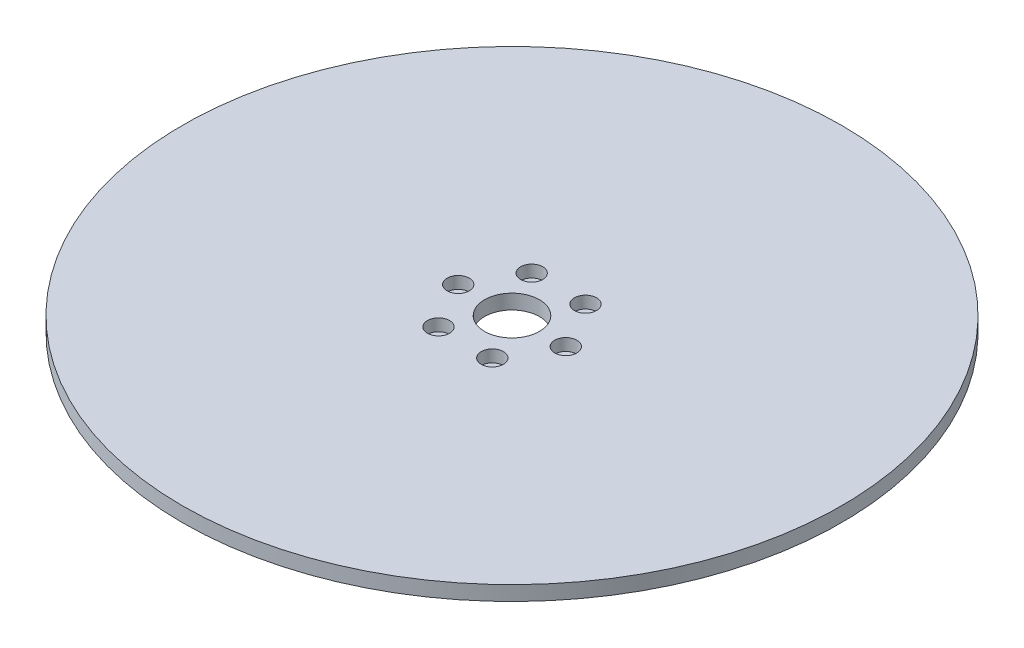
ISO-10303-21;
HEADER;
FILE_DESCRIPTION(('STEP AP214'),'2;1');
FILE_NAME('part.step','',(''),(''),'','','');
FILE_SCHEMA(('AUTOMOTIVE_DESIGN { 1 0 10303 214 1 1 1 1 }'));
ENDSEC;
DATA;
#1=APPLICATION_CONTEXT('core data for automotive mechanical design processes');
#2=APPLICATION_PROTOCOL_DEFINITION('international standard','automotive_design',2000,#1);
#3=PRODUCT_CONTEXT('',#1,'mechanical');
#4=PRODUCT('Part','Part','',(#3));
#5=PRODUCT_RELATED_PRODUCT_CATEGORY('part','',(#4));
#6=PRODUCT_DEFINITION_FORMATION('','',#4);
#7=PRODUCT_DEFINITION_CONTEXT('part definition',#1,'design');
#8=PRODUCT_DEFINITION('design','',#6,#7);
#9=PRODUCT_DEFINITION_SHAPE('','',#8);
#10=(LENGTH_UNIT() NAMED_UNIT(*) SI_UNIT(.MILLI.,.METRE.));
#11=(NAMED_UNIT(*) PLANE_ANGLE_UNIT() SI_UNIT($,.RADIAN.));
#12=(NAMED_UNIT(*) SI_UNIT($,.STERADIAN.) SOLID_ANGLE_UNIT());
#13=UNCERTAINTY_MEASURE_WITH_UNIT(LENGTH_MEASURE(1.E-05),#10,'distance_accuracy_value','');
#14=(GEOMETRIC_REPRESENTATION_CONTEXT(3) GLOBAL_UNCERTAINTY_ASSIGNED_CONTEXT((#13)) GLOBAL_UNIT_ASSIGNED_CONTEXT((#10,
#11,#12)) REPRESENTATION_CONTEXT('',''));
#15=CARTESIAN_POINT('',(0.,0.,0.));
#16=DIRECTION('',(0.,0.,1.));
#17=DIRECTION('',(1.,0.,0.));
#18=AXIS2_PLACEMENT_3D('',#15,#16,#17);
#19=CARTESIAN_POINT('',(0.,4.,0.));
#20=DIRECTION('',(0.,-1.,0.));
#21=DIRECTION('',(0.,0.,-1.));
#22=AXIS2_PLACEMENT_3D('',#19,#20,#21);
#23=CYLINDRICAL_SURFACE('',#22,90.);
#24=CARTESIAN_POINT('',(0.,4.,0.));
#25=DIRECTION('',(0.,1.,0.));
#26=DIRECTION('',(0.,0.,1.));
#27=AXIS2_PLACEMENT_3D('',#24,#25,#26);
#28=CIRCLE('',#27,90.);
#29=CARTESIAN_POINT('',(0.,4.,90.));
#30=VERTEX_POINT('',#29);
#31=EDGE_CURVE('E10',#30,#30,#28,.T.);
#32=ORIENTED_EDGE('',*,*,#31,.F.);
#33=EDGE_LOOP('',(#32));
#34=FACE_BOUND('',#33,.T.);
#35=CARTESIAN_POINT('',(0.,0.,0.));
#36=DIRECTION('',(0.,1.,0.));
#37=DIRECTION('',(0.,0.,1.));
#38=AXIS2_PLACEMENT_3D('',#35,#36,#37);
#39=CIRCLE('',#38,90.);
#40=CARTESIAN_POINT('',(0.,0.,90.));
#41=VERTEX_POINT('',#40);
#42=EDGE_CURVE('E37',#41,#41,#39,.T.);
#43=ORIENTED_EDGE('',*,*,#42,.T.);
#44=EDGE_LOOP('',(#43));
#45=FACE_BOUND('',#44,.T.);
#46=ADVANCED_FACE('F40',(#34,#45),#23,.T.);
#47=CARTESIAN_POINT('',(0.,4.,0.));
#48=DIRECTION('',(0.,1.,0.));
#49=DIRECTION('',(0.,0.,1.));
#50=AXIS2_PLACEMENT_3D('',#47,#48,#49);
#51=PLANE('',#50);
#52=CARTESIAN_POINT('',(-7.34479010541162,4.,-12.7215496335017));
#53=DIRECTION('',(0.,1.,0.));
#54=DIRECTION('',(-0.866025403784433,0.,0.50000000000001));
#55=AXIS2_PLACEMENT_3D('',#52,#53,#54);
#56=CIRCLE('',#55,3.02376770295141);
#57=CARTESIAN_POINT('',(-9.96344975131043,4.,-11.209665782026));
#58=VERTEX_POINT('',#57);
#59=EDGE_CURVE('E70',#58,#58,#56,.T.);
#60=ORIENTED_EDGE('',*,*,#59,.F.);
#61=EDGE_LOOP('',(#60));
#62=FACE_BOUND('',#61,.T.);
#63=CARTESIAN_POINT('',(7.34479010541135,4.,-12.7215496335019));
#64=DIRECTION('',(0.,1.,0.));
#65=DIRECTION('',(-0.866025403784443,0.,-0.499999999999992));
#66=AXIS2_PLACEMENT_3D('',#63,#64,#65);
#67=CIRCLE('',#66,3.02376770295141);
#68=CARTESIAN_POINT('',(4.7261304595125,4.,-14.2334334849776));
#69=VERTEX_POINT('',#68);
#70=EDGE_CURVE('E71',#69,#69,#67,.T.);
#71=ORIENTED_EDGE('',*,*,#70,.F.);
#72=EDGE_LOOP('',(#71));
#73=FACE_BOUND('',#72,.T.);
#74=CARTESIAN_POINT('',(14.6895802108229,4.,0.));
#75=DIRECTION('',(0.,1.,0.));
#76=DIRECTION('',(0.,0.,-1.));
#77=AXIS2_PLACEMENT_3D('',#74,#75,#76);
#78=CIRCLE('',#77,3.02376770295141);
#79=CARTESIAN_POINT('',(14.6895802108229,4.,-3.02376770295141));
#80=VERTEX_POINT('',#79);
#81=EDGE_CURVE('E78',#80,#80,#78,.T.);
#82=ORIENTED_EDGE('',*,*,#81,.F.);
#83=EDGE_LOOP('',(#82));
#84=FACE_BOUND('',#83,.T.);
#85=CARTESIAN_POINT('',(7.34479010541153,4.,12.7215496335018));
#86=DIRECTION('',(0.,1.,0.));
#87=DIRECTION('',(0.866025403784436,0.,-0.500000000000004));
#88=AXIS2_PLACEMENT_3D('',#85,#86,#87);
#89=CIRCLE('',#88,3.02376770295141);
#90=CARTESIAN_POINT('',(9.96344975131036,4.,11.2096657820261));
#91=VERTEX_POINT('',#90);
#92=EDGE_CURVE('E84',#91,#91,#89,.T.);
#93=ORIENTED_EDGE('',*,*,#92,.F.);
#94=EDGE_LOOP('',(#93));
#95=FACE_BOUND('',#94,.T.);
#96=CARTESIAN_POINT('',(-7.34479010541144,4.,12.7215496335018));
#97=DIRECTION('',(0.,1.,0.));
#98=DIRECTION('',(0.86602540378444,0.,0.499999999999998));
#99=AXIS2_PLACEMENT_3D('',#96,#97,#98);
#100=CIRCLE('',#99,3.02376770295141);
#101=CARTESIAN_POINT('',(-4.7261304595126,4.,14.2334334849775));
#102=VERTEX_POINT('',#101);
#103=EDGE_CURVE('E61',#102,#102,#100,.T.);
#104=ORIENTED_EDGE('',*,*,#103,.F.);
#105=EDGE_LOOP('',(#104));
#106=FACE_BOUND('',#105,.T.);
#107=CARTESIAN_POINT('',(-14.6895802108229,4.,0.));
#108=DIRECTION('',(0.,1.,0.));
#109=DIRECTION('',(0.,0.,1.));
#110=AXIS2_PLACEMENT_3D('',#107,#108,#109);
#111=CIRCLE('',#110,3.02376770295141);
#112=CARTESIAN_POINT('',(-14.6895802108229,4.,3.02376770295141));
#113=VERTEX_POINT('',#112);
#114=EDGE_CURVE('E54',#113,#113,#111,.T.);
#115=ORIENTED_EDGE('',*,*,#114,.F.);
#116=EDGE_LOOP('',(#115));
#117=FACE_BOUND('',#116,.T.);
#118=CARTESIAN_POINT('',(0.,4.,0.));
#119=DIRECTION('',(0.,1.,0.));
#120=DIRECTION('',(0.,0.,1.));
#121=AXIS2_PLACEMENT_3D('',#118,#119,#120);
#122=CIRCLE('',#121,7.5);
#123=CARTESIAN_POINT('',(0.,4.,7.5));
#124=VERTEX_POINT('',#123);
#125=EDGE_CURVE('E50',#124,#124,#122,.T.);
#126=ORIENTED_EDGE('',*,*,#125,.F.);
#127=EDGE_LOOP('',(#126));
#128=FACE_BOUND('',#127,.T.);
#129=ORIENTED_EDGE('',*,*,#31,.T.);
#130=EDGE_LOOP('',(#129));
#131=FACE_BOUND('',#130,.T.);
#132=ADVANCED_FACE('F99',(#62,#73,#84,#95,#106,#117,#128,#131),#51,.T.);
#133=CARTESIAN_POINT('',(0.,0.,0.));
#134=DIRECTION('',(0.,1.,0.));
#135=DIRECTION('',(0.,0.,1.));
#136=AXIS2_PLACEMENT_3D('',#133,#134,#135);
#137=PLANE('',#136);
#138=CARTESIAN_POINT('',(0.,0.,0.));
#139=DIRECTION('',(0.,1.,0.));
#140=DIRECTION('',(0.,0.,1.));
#141=AXIS2_PLACEMENT_3D('',#138,#139,#140);
#142=CIRCLE('',#141,7.5);
#143=CARTESIAN_POINT('',(0.,0.,7.5));
#144=VERTEX_POINT('',#143);
#145=EDGE_CURVE('E47',#144,#144,#142,.T.);
#146=ORIENTED_EDGE('',*,*,#145,.T.);
#147=EDGE_LOOP('',(#146));
#148=FACE_BOUND('',#147,.T.);
#149=ORIENTED_EDGE('',*,*,#42,.F.);
#150=EDGE_LOOP('',(#149));
#151=FACE_BOUND('',#150,.T.);
#152=ADVANCED_FACE('F103',(#148,#151),#137,.F.);
#153=CARTESIAN_POINT('',(0.,4.,0.));
#154=DIRECTION('',(0.,-1.,0.));
#155=DIRECTION('',(0.,0.,-1.));
#156=AXIS2_PLACEMENT_3D('',#153,#154,#155);
#157=CYLINDRICAL_SURFACE('',#156,7.5);
#158=ORIENTED_EDGE('',*,*,#125,.T.);
#159=EDGE_LOOP('',(#158));
#160=FACE_BOUND('',#159,.T.);
#161=ORIENTED_EDGE('',*,*,#145,.F.);
#162=EDGE_LOOP('',(#161));
#163=FACE_BOUND('',#162,.T.);
#164=ADVANCED_FACE('F115',(#160,#163),#157,.F.);
#165=CARTESIAN_POINT('',(-14.6895802108229,0.702994223056032,0.));
#166=DIRECTION('',(0.,1.,0.));
#167=DIRECTION('',(0.,0.,1.));
#168=AXIS2_PLACEMENT_3D('',#165,#166,#167);
#169=CYLINDRICAL_SURFACE('',#168,3.02376770295141);
#170=CARTESIAN_POINT('',(-14.6895802108229,0.702994223056032,0.));
#171=DIRECTION('',(0.,1.,0.));
#172=DIRECTION('',(0.,0.,1.));
#173=AXIS2_PLACEMENT_3D('',#170,#171,#172);
#174=CIRCLE('',#173,3.02376770295141);
#175=CARTESIAN_POINT('',(-14.6895802108229,0.702994223056032,3.02376770295141));
#176=VERTEX_POINT('',#175);
#177=EDGE_CURVE('E55',#176,#176,#174,.T.);
#178=ORIENTED_EDGE('',*,*,#177,.F.);
#179=EDGE_LOOP('',(#178));
#180=FACE_BOUND('',#179,.T.);
#181=ORIENTED_EDGE('',*,*,#114,.T.);
#182=EDGE_LOOP('',(#181));
#183=FACE_BOUND('',#182,.T.);
#184=ADVANCED_FACE('F113',(#180,#183),#169,.F.);
#185=CARTESIAN_POINT('',(-14.6895802108229,0.702994223056032,0.));
#186=DIRECTION('',(0.,1.,0.));
#187=DIRECTION('',(0.,0.,1.));
#188=AXIS2_PLACEMENT_3D('',#185,#186,#187);
#189=PLANE('',#188);
#190=ORIENTED_EDGE('',*,*,#177,.T.);
#191=EDGE_LOOP('',(#190));
#192=FACE_BOUND('',#191,.T.);
#193=ADVANCED_FACE('F144',(#192),#189,.T.);
#194=CARTESIAN_POINT('',(-7.34479010541144,0.702994223056032,12.7215496335018));
#195=DIRECTION('',(0.,1.,0.));
#196=DIRECTION('',(0.,0.,1.));
#197=AXIS2_PLACEMENT_3D('',#194,#195,#196);
#198=CYLINDRICAL_SURFACE('',#197,3.02376770295141);
#199=CARTESIAN_POINT('',(-7.34479010541144,0.702994223056032,12.7215496335018));
#200=DIRECTION('',(0.,1.,0.));
#201=DIRECTION('',(0.86602540378444,0.,0.499999999999998));
#202=AXIS2_PLACEMENT_3D('',#199,#200,#201);
#203=CIRCLE('',#202,3.02376770295141);
#204=CARTESIAN_POINT('',(-4.7261304595126,0.702994223056032,14.2334334849775));
#205=VERTEX_POINT('',#204);
#206=EDGE_CURVE('E59',#205,#205,#203,.T.);
#207=ORIENTED_EDGE('',*,*,#206,.F.);
#208=EDGE_LOOP('',(#207));
#209=FACE_BOUND('',#208,.T.);
#210=ORIENTED_EDGE('',*,*,#103,.T.);
#211=EDGE_LOOP('',(#210));
#212=FACE_BOUND('',#211,.T.);
#213=ADVANCED_FACE('F153',(#209,#212),#198,.F.);
#214=CARTESIAN_POINT('',(-7.34479010541144,0.702994223056032,12.7215496335018));
#215=DIRECTION('',(0.,1.,0.));
#216=DIRECTION('',(0.86602540378444,0.,0.499999999999998));
#217=AXIS2_PLACEMENT_3D('',#214,#215,#216);
#218=PLANE('',#217);
#219=ORIENTED_EDGE('',*,*,#206,.T.);
#220=EDGE_LOOP('',(#219));
#221=FACE_BOUND('',#220,.T.);
#222=ADVANCED_FACE('F96',(#221),#218,.T.);
#223=CARTESIAN_POINT('',(7.34479010541153,0.702994223056032,12.7215496335018));
#224=DIRECTION('',(0.,1.,0.));
#225=DIRECTION('',(0.,0.,1.));
#226=AXIS2_PLACEMENT_3D('',#223,#224,#225);
#227=CYLINDRICAL_SURFACE('',#226,3.02376770295141);
#228=CARTESIAN_POINT('',(7.34479010541153,0.702994223056032,12.7215496335018));
#229=DIRECTION('',(0.,1.,0.));
#230=DIRECTION('',(0.866025403784436,0.,-0.500000000000004));
#231=AXIS2_PLACEMENT_3D('',#228,#229,#230);
#232=CIRCLE('',#231,3.02376770295141);
#233=CARTESIAN_POINT('',(9.96344975131036,0.702994223056032,11.2096657820261));
#234=VERTEX_POINT('',#233);
#235=EDGE_CURVE('E63',#234,#234,#232,.T.);
#236=ORIENTED_EDGE('',*,*,#235,.F.);
#237=EDGE_LOOP('',(#236));
#238=FACE_BOUND('',#237,.T.);
#239=ORIENTED_EDGE('',*,*,#92,.T.);
#240=EDGE_LOOP('',(#239));
#241=FACE_BOUND('',#240,.T.);
#242=ADVANCED_FACE('F91',(#238,#241),#227,.F.);
#243=CARTESIAN_POINT('',(7.34479010541153,0.702994223056032,12.7215496335018));
#244=DIRECTION('',(0.,1.,0.));
#245=DIRECTION('',(0.866025403784436,0.,-0.500000000000004));
#246=AXIS2_PLACEMENT_3D('',#243,#244,#245);
#247=PLANE('',#246);
#248=ORIENTED_EDGE('',*,*,#235,.T.);
#249=EDGE_LOOP('',(#248));
#250=FACE_BOUND('',#249,.T.);
#251=ADVANCED_FACE('F93',(#250),#247,.T.);
#252=CARTESIAN_POINT('',(14.6895802108229,0.702994223056032,0.));
#253=DIRECTION('',(0.,1.,0.));
#254=DIRECTION('',(0.,0.,1.));
#255=AXIS2_PLACEMENT_3D('',#252,#253,#254);
#256=CYLINDRICAL_SURFACE('',#255,3.02376770295141);
#257=CARTESIAN_POINT('',(14.6895802108229,0.702994223056032,0.));
#258=DIRECTION('',(0.,1.,0.));
#259=DIRECTION('',(0.,0.,-1.));
#260=AXIS2_PLACEMENT_3D('',#257,#258,#259);
#261=CIRCLE('',#260,3.02376770295141);
#262=CARTESIAN_POINT('',(14.6895802108229,0.702994223056032,-3.02376770295141));
#263=VERTEX_POINT('',#262);
#264=EDGE_CURVE('E85',#263,#263,#261,.T.);
#265=ORIENTED_EDGE('',*,*,#264,.F.);
#266=EDGE_LOOP('',(#265));
#267=FACE_BOUND('',#266,.T.);
#268=ORIENTED_EDGE('',*,*,#81,.T.);
#269=EDGE_LOOP('',(#268));
#270=FACE_BOUND('',#269,.T.);
#271=ADVANCED_FACE('F187',(#267,#270),#256,.F.);
#272=CARTESIAN_POINT('',(14.6895802108229,0.702994223056032,0.));
#273=DIRECTION('',(0.,1.,0.));
#274=DIRECTION('',(0.,0.,-1.));
#275=AXIS2_PLACEMENT_3D('',#272,#273,#274);
#276=PLANE('',#275);
#277=ORIENTED_EDGE('',*,*,#264,.T.);
#278=EDGE_LOOP('',(#277));
#279=FACE_BOUND('',#278,.T.);
#280=ADVANCED_FACE('F198',(#279),#276,.T.);
#281=CARTESIAN_POINT('',(7.34479010541135,0.702994223056032,-12.7215496335019));
#282=DIRECTION('',(0.,1.,0.));
#283=DIRECTION('',(0.,0.,1.));
#284=AXIS2_PLACEMENT_3D('',#281,#282,#283);
#285=CYLINDRICAL_SURFACE('',#284,3.02376770295141);
#286=CARTESIAN_POINT('',(7.34479010541135,0.702994223056032,-12.7215496335019));
#287=DIRECTION('',(0.,1.,0.));
#288=DIRECTION('',(-0.866025403784443,0.,-0.499999999999992));
#289=AXIS2_PLACEMENT_3D('',#286,#287,#288);
#290=CIRCLE('',#289,3.02376770295141);
#291=CARTESIAN_POINT('',(4.7261304595125,0.702994223056032,-14.2334334849776));
#292=VERTEX_POINT('',#291);
#293=EDGE_CURVE('E76',#292,#292,#290,.T.);
#294=ORIENTED_EDGE('',*,*,#293,.F.);
#295=EDGE_LOOP('',(#294));
#296=FACE_BOUND('',#295,.T.);
#297=ORIENTED_EDGE('',*,*,#70,.T.);
#298=EDGE_LOOP('',(#297));
#299=FACE_BOUND('',#298,.T.);
#300=ADVANCED_FACE('F202',(#296,#299),#285,.F.);
#301=CARTESIAN_POINT('',(7.34479010541135,0.702994223056032,-12.7215496335019));
#302=DIRECTION('',(0.,1.,0.));
#303=DIRECTION('',(-0.866025403784443,0.,-0.499999999999992));
#304=AXIS2_PLACEMENT_3D('',#301,#302,#303);
#305=PLANE('',#304);
#306=ORIENTED_EDGE('',*,*,#293,.T.);
#307=EDGE_LOOP('',(#306));
#308=FACE_BOUND('',#307,.T.);
#309=ADVANCED_FACE('F212',(#308),#305,.T.);
#310=CARTESIAN_POINT('',(-7.34479010541162,0.702994223056032,-12.7215496335017));
#311=DIRECTION('',(0.,1.,0.));
#312=DIRECTION('',(0.,0.,1.));
#313=AXIS2_PLACEMENT_3D('',#310,#311,#312);
#314=CYLINDRICAL_SURFACE('',#313,3.02376770295141);
#315=CARTESIAN_POINT('',(-7.34479010541162,0.702994223056032,-12.7215496335017));
#316=DIRECTION('',(0.,1.,0.));
#317=DIRECTION('',(-0.866025403784433,0.,0.50000000000001));
#318=AXIS2_PLACEMENT_3D('',#315,#316,#317);
#319=CIRCLE('',#318,3.02376770295141);
#320=CARTESIAN_POINT('',(-9.96344975131043,0.702994223056032,-11.209665782026));
#321=VERTEX_POINT('',#320);
#322=EDGE_CURVE('E69',#321,#321,#319,.T.);
#323=ORIENTED_EDGE('',*,*,#322,.F.);
#324=EDGE_LOOP('',(#323));
#325=FACE_BOUND('',#324,.T.);
#326=ORIENTED_EDGE('',*,*,#59,.T.);
#327=EDGE_LOOP('',(#326));
#328=FACE_BOUND('',#327,.T.);
#329=ADVANCED_FACE('F224',(#325,#328),#314,.F.);
#330=CARTESIAN_POINT('',(-7.34479010541162,0.702994223056032,-12.7215496335017));
#331=DIRECTION('',(0.,1.,0.));
#332=DIRECTION('',(-0.866025403784433,0.,0.50000000000001));
#333=AXIS2_PLACEMENT_3D('',#330,#331,#332);
#334=PLANE('',#333);
#335=ORIENTED_EDGE('',*,*,#322,.T.);
#336=EDGE_LOOP('',(#335));
#337=FACE_BOUND('',#336,.T.);
#338=ADVANCED_FACE('F235',(#337),#334,.T.);
#339=CLOSED_SHELL('',(#46,#132,#152,#164,#184,#193,#213,#222,#242,#251,#271,#280,#300,#309,#329,#338));
#340=MANIFOLD_SOLID_BREP('B2',#339);
#341=ADVANCED_BREP_SHAPE_REPRESENTATION('',(#18,#340),#14);
#342=SHAPE_DEFINITION_REPRESENTATION(#9,#341);
ENDSEC;
END-ISO-10303-21;
